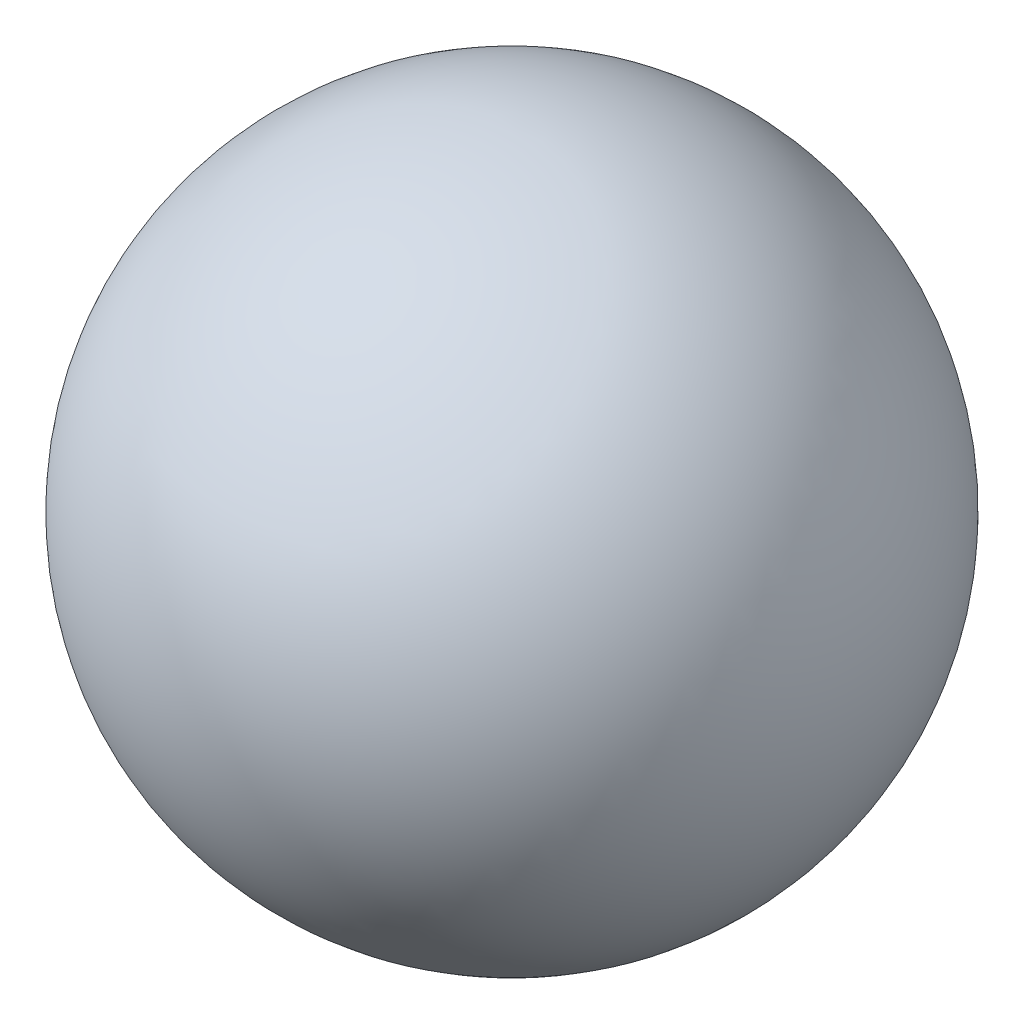
ISO-10303-21;
HEADER;
FILE_DESCRIPTION(('STEP AP214'),'2;1');
FILE_NAME('part.step','',(''),(''),'','','');
FILE_SCHEMA(('AUTOMOTIVE_DESIGN { 1 0 10303 214 1 1 1 1 }'));
ENDSEC;
DATA;
#1=APPLICATION_CONTEXT('core data for automotive mechanical design processes');
#2=APPLICATION_PROTOCOL_DEFINITION('international standard','automotive_design',2000,#1);
#3=PRODUCT_CONTEXT('',#1,'mechanical');
#4=PRODUCT('Part','Part','',(#3));
#5=PRODUCT_RELATED_PRODUCT_CATEGORY('part','',(#4));
#6=PRODUCT_DEFINITION_FORMATION('','',#4);
#7=PRODUCT_DEFINITION_CONTEXT('part definition',#1,'design');
#8=PRODUCT_DEFINITION('design','',#6,#7);
#9=PRODUCT_DEFINITION_SHAPE('','',#8);
#10=(LENGTH_UNIT() NAMED_UNIT(*) SI_UNIT(.MILLI.,.METRE.));
#11=(NAMED_UNIT(*) PLANE_ANGLE_UNIT() SI_UNIT($,.RADIAN.));
#12=(NAMED_UNIT(*) SI_UNIT($,.STERADIAN.) SOLID_ANGLE_UNIT());
#13=UNCERTAINTY_MEASURE_WITH_UNIT(LENGTH_MEASURE(1.E-05),#10,'distance_accuracy_value','');
#14=(GEOMETRIC_REPRESENTATION_CONTEXT(3) GLOBAL_UNCERTAINTY_ASSIGNED_CONTEXT((#13)) GLOBAL_UNIT_ASSIGNED_CONTEXT((#10,
#11,#12)) REPRESENTATION_CONTEXT('',''));
#15=CARTESIAN_POINT('',(0.,0.,0.));
#16=DIRECTION('',(0.,0.,1.));
#17=DIRECTION('',(1.,0.,0.));
#18=AXIS2_PLACEMENT_3D('',#15,#16,#17);
#19=CARTESIAN_POINT('',(0.,-26.,0.));
#20=DIRECTION('',(0.,-1.,0.));
#21=DIRECTION('',(0.,0.,-1.));
#22=AXIS2_PLACEMENT_3D('',#19,#20,#21);
#23=PLANE('',#22);
#24=CARTESIAN_POINT('',(0.,-26.,0.));
#25=DIRECTION('',(0.,-1.,0.));
#26=DIRECTION('',(0.,0.,-1.));
#27=AXIS2_PLACEMENT_3D('',#24,#25,#26);
#28=CIRCLE('',#27,6.);
#29=CARTESIAN_POINT('',(0.,-26.,-6.));
#30=VERTEX_POINT('',#29);
#31=EDGE_CURVE('E40',#30,#30,#28,.T.);
#32=ORIENTED_EDGE('',*,*,#31,.F.);
#33=EDGE_LOOP('',(#32));
#34=FACE_BOUND('',#33,.T.);
#35=CARTESIAN_POINT('',(0.,-26.,0.));
#36=DIRECTION('',(0.,-1.,0.));
#37=DIRECTION('',(0.,0.,-1.));
#38=AXIS2_PLACEMENT_3D('',#35,#36,#37);
#39=CIRCLE('',#38,14.9666295470958);
#40=CARTESIAN_POINT('',(0.,-26.,-14.9666295470958));
#41=VERTEX_POINT('',#40);
#42=EDGE_CURVE('E10',#41,#41,#39,.T.);
#43=ORIENTED_EDGE('',*,*,#42,.T.);
#44=EDGE_LOOP('',(#43));
#45=FACE_BOUND('',#44,.T.);
#46=ADVANCED_FACE('F30',(#34,#45),#23,.T.);
#47=CARTESIAN_POINT('',(0.,0.,0.));
#48=DIRECTION('',(0.,-1.,0.));
#49=DIRECTION('',(1.,0.,0.));
#50=AXIS2_PLACEMENT_3D('',#47,#48,#49);
#51=SPHERICAL_SURFACE('',#50,30.);
#52=ORIENTED_EDGE('',*,*,#42,.F.);
#53=EDGE_LOOP('',(#52));
#54=FACE_BOUND('',#53,.T.);
#55=ADVANCED_FACE('F50',(#54),#51,.T.);
#56=CARTESIAN_POINT('',(0.,-14.,0.));
#57=DIRECTION('',(0.,-1.,0.));
#58=DIRECTION('',(0.,0.,-1.));
#59=AXIS2_PLACEMENT_3D('',#56,#57,#58);
#60=CYLINDRICAL_SURFACE('',#59,6.);
#61=CARTESIAN_POINT('',(0.,-14.,0.));
#62=DIRECTION('',(0.,-1.,0.));
#63=DIRECTION('',(0.,0.,-1.));
#64=AXIS2_PLACEMENT_3D('',#61,#62,#63);
#65=CIRCLE('',#64,6.);
#66=CARTESIAN_POINT('',(0.,-14.,-6.));
#67=VERTEX_POINT('',#66);
#68=EDGE_CURVE('E36',#67,#67,#65,.T.);
#69=ORIENTED_EDGE('',*,*,#68,.F.);
#70=EDGE_LOOP('',(#69));
#71=FACE_BOUND('',#70,.T.);
#72=ORIENTED_EDGE('',*,*,#31,.T.);
#73=EDGE_LOOP('',(#72));
#74=FACE_BOUND('',#73,.T.);
#75=ADVANCED_FACE('F47',(#71,#74),#60,.F.);
#76=CARTESIAN_POINT('',(0.,-14.,0.));
#77=DIRECTION('',(0.,-1.,0.));
#78=DIRECTION('',(0.,0.,-1.));
#79=AXIS2_PLACEMENT_3D('',#76,#77,#78);
#80=PLANE('',#79);
#81=ORIENTED_EDGE('',*,*,#68,.T.);
#82=EDGE_LOOP('',(#81));
#83=FACE_BOUND('',#82,.T.);
#84=ADVANCED_FACE('F58',(#83),#80,.T.);
#85=CLOSED_SHELL('',(#46,#55,#75,#84));
#86=MANIFOLD_SOLID_BREP('B2',#85);
#87=ADVANCED_BREP_SHAPE_REPRESENTATION('',(#18,#86),#14);
#88=SHAPE_DEFINITION_REPRESENTATION(#9,#87);
ENDSEC;
END-ISO-10303-21;
